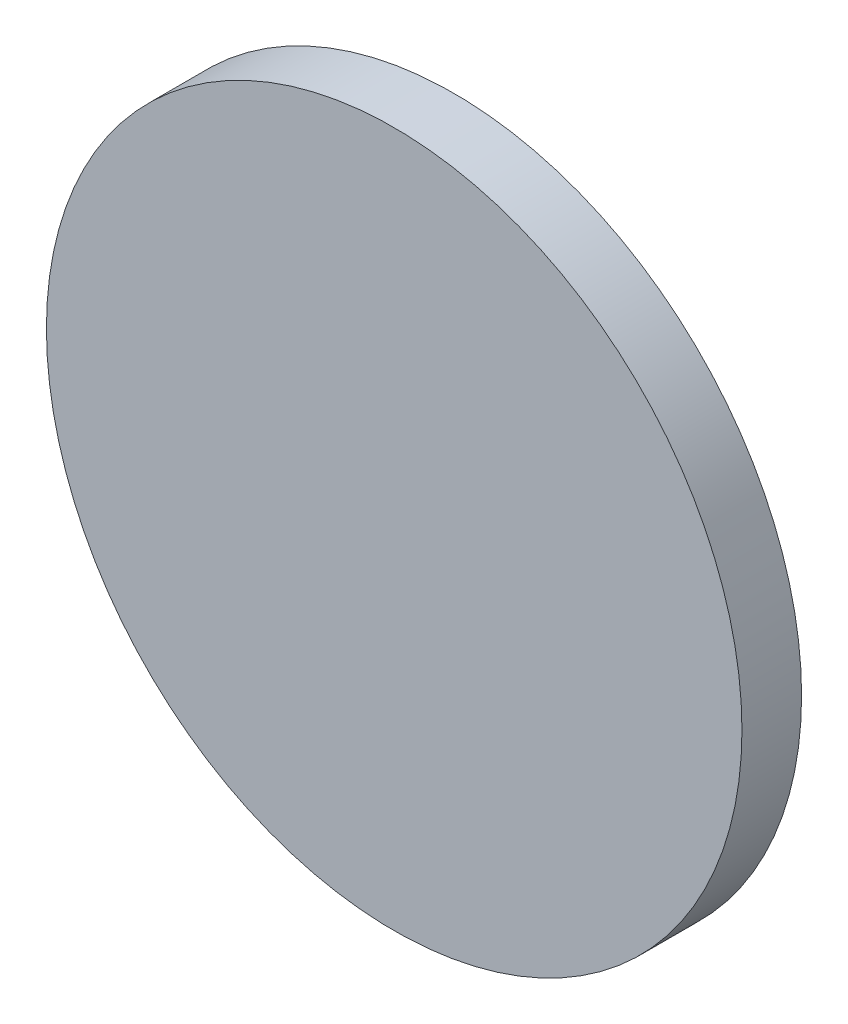
ISO-10303-21;
HEADER;
FILE_DESCRIPTION(('STEP AP214'),'2;1');
FILE_NAME('part.step','',(''),(''),'','','');
FILE_SCHEMA(('AUTOMOTIVE_DESIGN { 1 0 10303 214 1 1 1 1 }'));
ENDSEC;
DATA;
#1=APPLICATION_CONTEXT('core data for automotive mechanical design processes');
#2=APPLICATION_PROTOCOL_DEFINITION('international standard','automotive_design',2000,#1);
#3=PRODUCT_CONTEXT('',#1,'mechanical');
#4=PRODUCT('Part','Part','',(#3));
#5=PRODUCT_RELATED_PRODUCT_CATEGORY('part','',(#4));
#6=PRODUCT_DEFINITION_FORMATION('','',#4);
#7=PRODUCT_DEFINITION_CONTEXT('part definition',#1,'design');
#8=PRODUCT_DEFINITION('design','',#6,#7);
#9=PRODUCT_DEFINITION_SHAPE('','',#8);
#10=(LENGTH_UNIT() NAMED_UNIT(*) SI_UNIT(.MILLI.,.METRE.));
#11=(NAMED_UNIT(*) PLANE_ANGLE_UNIT() SI_UNIT($,.RADIAN.));
#12=(NAMED_UNIT(*) SI_UNIT($,.STERADIAN.) SOLID_ANGLE_UNIT());
#13=UNCERTAINTY_MEASURE_WITH_UNIT(LENGTH_MEASURE(1.E-05),#10,'distance_accuracy_value','');
#14=(GEOMETRIC_REPRESENTATION_CONTEXT(3) GLOBAL_UNCERTAINTY_ASSIGNED_CONTEXT((#13)) GLOBAL_UNIT_ASSIGNED_CONTEXT((#10,
#11,#12)) REPRESENTATION_CONTEXT('',''));
#15=CARTESIAN_POINT('',(0.,0.,0.));
#16=DIRECTION('',(0.,0.,1.));
#17=DIRECTION('',(1.,0.,0.));
#18=AXIS2_PLACEMENT_3D('',#15,#16,#17);
#19=CARTESIAN_POINT('',(1.30008,10.400000006176,0.79916));
#20=DIRECTION('',(0.,0.,1.));
#21=DIRECTION('',(1.,0.,0.));
#22=AXIS2_PLACEMENT_3D('',#19,#20,#21);
#23=PLANE('',#22);
#24=CARTESIAN_POINT('',(1.30008,10.400000006176,0.79916));
#25=DIRECTION('',(0.,0.,1.));
#26=DIRECTION('',(1.,0.,0.));
#27=AXIS2_PLACEMENT_3D('',#24,#25,#26);
#28=CIRCLE('',#27,0.200024667);
#29=CARTESIAN_POINT('',(1.500104667,10.400000006176,0.79916));
#30=VERTEX_POINT('',#29);
#31=EDGE_CURVE('E18',#30,#30,#28,.F.);
#32=ORIENTED_EDGE('',*,*,#31,.F.);
#33=EDGE_LOOP('',(#32));
#34=FACE_BOUND('',#33,.T.);
#35=ADVANCED_FACE('F15',(#34),#23,.T.);
#36=CARTESIAN_POINT('',(1.30008,10.400000006176,0.76487));
#37=DIRECTION('',(0.,0.,1.));
#38=DIRECTION('',(1.,0.,0.));
#39=AXIS2_PLACEMENT_3D('',#36,#37,#38);
#40=CYLINDRICAL_SURFACE('',#39,0.200024667);
#41=ORIENTED_EDGE('',*,*,#31,.T.);
#42=EDGE_LOOP('',(#41));
#43=FACE_BOUND('',#42,.T.);
#44=CARTESIAN_POINT('',(1.30008,10.400000006176,0.76487));
#45=DIRECTION('',(0.,0.,1.));
#46=DIRECTION('',(1.,0.,0.));
#47=AXIS2_PLACEMENT_3D('',#44,#45,#46);
#48=CIRCLE('',#47,0.200024667);
#49=CARTESIAN_POINT('',(1.500104667,10.400000006176,0.76487));
#50=VERTEX_POINT('',#49);
#51=EDGE_CURVE('E10',#50,#50,#48,.F.);
#52=ORIENTED_EDGE('',*,*,#51,.F.);
#53=EDGE_LOOP('',(#52));
#54=FACE_BOUND('',#53,.T.);
#55=ADVANCED_FACE('F27',(#43,#54),#40,.T.);
#56=CARTESIAN_POINT('',(1.30008,10.400000006176,0.76487));
#57=DIRECTION('',(0.,0.,-1.));
#58=DIRECTION('',(-1.,0.,0.));
#59=AXIS2_PLACEMENT_3D('',#56,#57,#58);
#60=PLANE('',#59);
#61=ORIENTED_EDGE('',*,*,#51,.T.);
#62=EDGE_LOOP('',(#61));
#63=FACE_BOUND('',#62,.T.);
#64=ADVANCED_FACE('F35',(#63),#60,.T.);
#65=CLOSED_SHELL('',(#35,#55,#64));
#66=MANIFOLD_SOLID_BREP('B1',#65);
#67=ADVANCED_BREP_SHAPE_REPRESENTATION('',(#18,#66),#14);
#68=SHAPE_DEFINITION_REPRESENTATION(#9,#67);
ENDSEC;
END-ISO-10303-21;
